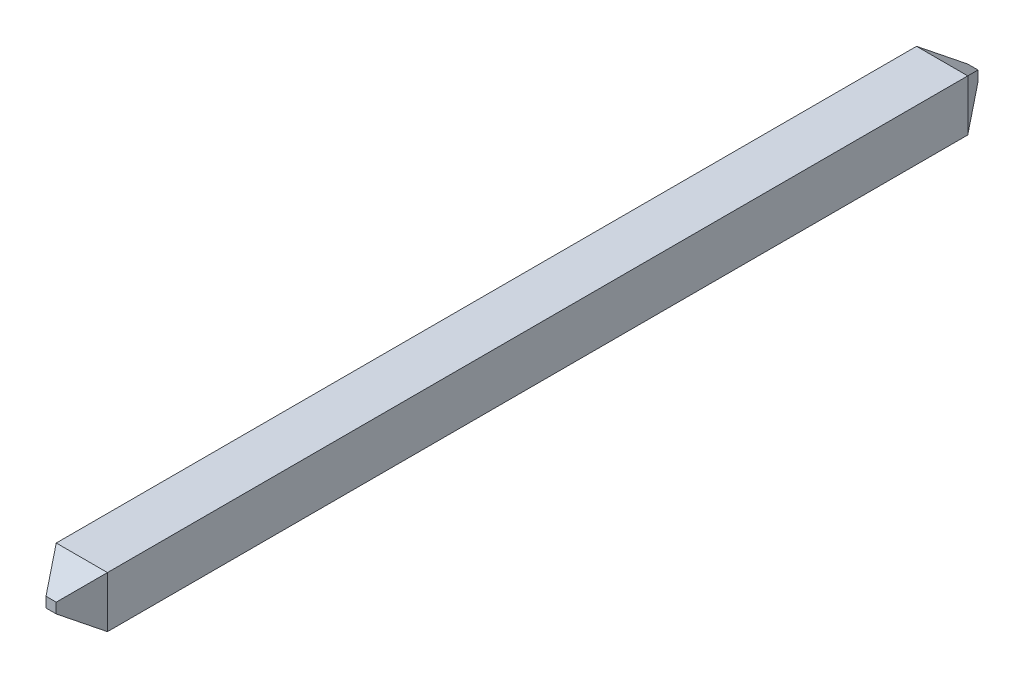
ISO-10303-21;
HEADER;
FILE_DESCRIPTION(('STEP AP214'),'2;1');
FILE_NAME('part.step','',(''),(''),'','','');
FILE_SCHEMA(('AUTOMOTIVE_DESIGN { 1 0 10303 214 1 1 1 1 }'));
ENDSEC;
DATA;
#1=APPLICATION_CONTEXT('core data for automotive mechanical design processes');
#2=APPLICATION_PROTOCOL_DEFINITION('international standard','automotive_design',2000,#1);
#3=PRODUCT_CONTEXT('',#1,'mechanical');
#4=PRODUCT('Part','Part','',(#3));
#5=PRODUCT_RELATED_PRODUCT_CATEGORY('part','',(#4));
#6=PRODUCT_DEFINITION_FORMATION('','',#4);
#7=PRODUCT_DEFINITION_CONTEXT('part definition',#1,'design');
#8=PRODUCT_DEFINITION('design','',#6,#7);
#9=PRODUCT_DEFINITION_SHAPE('','',#8);
#10=(LENGTH_UNIT() NAMED_UNIT(*) SI_UNIT(.MILLI.,.METRE.));
#11=(NAMED_UNIT(*) PLANE_ANGLE_UNIT() SI_UNIT($,.RADIAN.));
#12=(NAMED_UNIT(*) SI_UNIT($,.STERADIAN.) SOLID_ANGLE_UNIT());
#13=UNCERTAINTY_MEASURE_WITH_UNIT(LENGTH_MEASURE(1.E-05),#10,'distance_accuracy_value','');
#14=(GEOMETRIC_REPRESENTATION_CONTEXT(3) GLOBAL_UNCERTAINTY_ASSIGNED_CONTEXT((#13)) GLOBAL_UNIT_ASSIGNED_CONTEXT((#10,
#11,#12)) REPRESENTATION_CONTEXT('',''));
#15=CARTESIAN_POINT('',(0.,0.,0.));
#16=DIRECTION('',(0.,0.,1.));
#17=DIRECTION('',(1.,0.,0.));
#18=AXIS2_PLACEMENT_3D('',#15,#16,#17);
#19=CARTESIAN_POINT('',(-0.0635,0.,-6.35));
#20=DIRECTION('',(0.832050294337843,0.,0.55470019622523));
#21=DIRECTION('',(0.55470019622523,0.,-0.832050294337843));
#22=AXIS2_PLACEMENT_3D('',#19,#20,#21);
#23=PLANE('',#22);
#24=DIRECTION('',(0.,1.,0.));
#25=VECTOR('',#24,1.);
#26=CARTESIAN_POINT('',(-0.0635,0.,-6.35));
#27=LINE('',#26,#25);
#28=CARTESIAN_POINT('',(-0.0634999999999999,10.0965,-6.35));
#29=VERTEX_POINT('',#28);
#30=CARTESIAN_POINT('',(-0.0634999999999999,10.2235,-6.35));
#31=VERTEX_POINT('',#30);
#32=EDGE_CURVE('E19',#29,#31,#27,.T.);
#33=ORIENTED_EDGE('',*,*,#32,.F.);
#34=DIRECTION('',(-0.485071250072665,-0.485071250072667,0.727606875108999));
#35=VECTOR('',#34,1.);
#36=CARTESIAN_POINT('',(-0.0635,10.0965,-6.35));
#37=LINE('',#36,#35);
#38=CARTESIAN_POINT('',(-0.3175,9.8425,-5.969));
#39=VERTEX_POINT('',#38);
#40=EDGE_CURVE('E81',#29,#39,#37,.T.);
#41=ORIENTED_EDGE('',*,*,#40,.T.);
#42=DIRECTION('',(0.,1.,0.));
#43=VECTOR('',#42,1.);
#44=CARTESIAN_POINT('',(-0.3175,9.8425,-5.969));
#45=LINE('',#44,#43);
#46=CARTESIAN_POINT('',(-0.3175,10.4775,-5.969));
#47=VERTEX_POINT('',#46);
#48=EDGE_CURVE('E103',#47,#39,#45,.F.);
#49=ORIENTED_EDGE('',*,*,#48,.F.);
#50=DIRECTION('',(0.485071250072667,-0.485071250072668,-0.727606875108997));
#51=VECTOR('',#50,1.);
#52=CARTESIAN_POINT('',(-0.3175,10.4775,-5.969));
#53=LINE('',#52,#51);
#54=EDGE_CURVE('E84',#47,#31,#53,.T.);
#55=ORIENTED_EDGE('',*,*,#54,.T.);
#56=EDGE_LOOP('',(#33,#41,#49,#55));
#57=FACE_BOUND('',#56,.T.);
#58=ADVANCED_FACE('F16',(#57),#23,.F.);
#59=CARTESIAN_POINT('',(-0.3175,9.8425,4.699));
#60=DIRECTION('',(-0.832050294337844,0.,0.554700196225229));
#61=DIRECTION('',(0.554700196225229,0.,0.832050294337844));
#62=AXIS2_PLACEMENT_3D('',#59,#60,#61);
#63=PLANE('',#62);
#64=DIRECTION('',(0.485071250072666,-0.485071250072667,0.727606875108998));
#65=VECTOR('',#64,1.);
#66=CARTESIAN_POINT('',(-0.3175,10.4775,4.699));
#67=LINE('',#66,#65);
#68=CARTESIAN_POINT('',(-0.3175,10.4775,4.699));
#69=VERTEX_POINT('',#68);
#70=CARTESIAN_POINT('',(-0.0635,10.2235,5.08));
#71=VERTEX_POINT('',#70);
#72=EDGE_CURVE('E108',#69,#71,#67,.T.);
#73=ORIENTED_EDGE('',*,*,#72,.F.);
#74=DIRECTION('',(0.,1.,0.));
#75=VECTOR('',#74,1.);
#76=CARTESIAN_POINT('',(-0.3175,9.8425,4.699));
#77=LINE('',#76,#75);
#78=CARTESIAN_POINT('',(-0.3175,9.8425,4.699));
#79=VERTEX_POINT('',#78);
#80=EDGE_CURVE('E105',#79,#69,#77,.T.);
#81=ORIENTED_EDGE('',*,*,#80,.F.);
#82=DIRECTION('',(-0.485071250072665,-0.485071250072666,-0.727606875108999));
#83=VECTOR('',#82,1.);
#84=CARTESIAN_POINT('',(-0.0635,10.0965,5.08));
#85=LINE('',#84,#83);
#86=CARTESIAN_POINT('',(-0.0635,10.0965,5.08));
#87=VERTEX_POINT('',#86);
#88=EDGE_CURVE('E118',#87,#79,#85,.T.);
#89=ORIENTED_EDGE('',*,*,#88,.F.);
#90=DIRECTION('',(0.,1.,0.));
#91=VECTOR('',#90,1.);
#92=CARTESIAN_POINT('',(-0.0635,0.,5.08));
#93=LINE('',#92,#91);
#94=EDGE_CURVE('E111',#87,#71,#93,.T.);
#95=ORIENTED_EDGE('',*,*,#94,.T.);
#96=EDGE_LOOP('',(#73,#81,#89,#95));
#97=FACE_BOUND('',#96,.T.);
#98=ADVANCED_FACE('F182',(#97),#63,.T.);
#99=CARTESIAN_POINT('',(0.,0.,-6.35));
#100=DIRECTION('',(0.,0.,-1.));
#101=DIRECTION('',(-1.,0.,0.));
#102=AXIS2_PLACEMENT_3D('',#99,#100,#101);
#103=PLANE('',#102);
#104=ORIENTED_EDGE('',*,*,#32,.T.);
#105=DIRECTION('',(1.,0.,0.));
#106=VECTOR('',#105,1.);
#107=CARTESIAN_POINT('',(0.,10.2235,-6.35));
#108=LINE('',#107,#106);
#109=CARTESIAN_POINT('',(0.0634999999999999,10.2235,-6.35));
#110=VERTEX_POINT('',#109);
#111=EDGE_CURVE('E98',#31,#110,#108,.T.);
#112=ORIENTED_EDGE('',*,*,#111,.T.);
#113=DIRECTION('',(0.,1.,0.));
#114=VECTOR('',#113,1.);
#115=CARTESIAN_POINT('',(0.0635,0.,-6.35));
#116=LINE('',#115,#114);
#117=CARTESIAN_POINT('',(0.0634999999999999,10.0965,-6.35));
#118=VERTEX_POINT('',#117);
#119=EDGE_CURVE('E90',#110,#118,#116,.F.);
#120=ORIENTED_EDGE('',*,*,#119,.T.);
#121=DIRECTION('',(1.,0.,0.));
#122=VECTOR('',#121,1.);
#123=CARTESIAN_POINT('',(0.,10.0965,-6.35));
#124=LINE('',#123,#122);
#125=EDGE_CURVE('E86',#118,#29,#124,.F.);
#126=ORIENTED_EDGE('',*,*,#125,.T.);
#127=EDGE_LOOP('',(#104,#112,#120,#126));
#128=FACE_BOUND('',#127,.T.);
#129=ADVANCED_FACE('F88',(#128),#103,.T.);
#130=CARTESIAN_POINT('',(0.,10.0965,-6.35));
#131=DIRECTION('',(0.,0.832050294337843,0.554700196225231));
#132=DIRECTION('',(0.,-0.554700196225231,0.832050294337843));
#133=AXIS2_PLACEMENT_3D('',#130,#131,#132);
#134=PLANE('',#133);
#135=DIRECTION('',(1.,0.,0.));
#136=VECTOR('',#135,1.);
#137=CARTESIAN_POINT('',(0.3175,9.8425,-5.969));
#138=LINE('',#137,#136);
#139=CARTESIAN_POINT('',(0.3175,9.8425,-5.969));
#140=VERTEX_POINT('',#139);
#141=EDGE_CURVE('E96',#39,#140,#138,.T.);
#142=ORIENTED_EDGE('',*,*,#141,.F.);
#143=ORIENTED_EDGE('',*,*,#40,.F.);
#144=ORIENTED_EDGE('',*,*,#125,.F.);
#145=DIRECTION('',(0.485071250072665,-0.48507125007267,0.727606875108996));
#146=VECTOR('',#145,1.);
#147=CARTESIAN_POINT('',(0.0635,10.0965,-6.35));
#148=LINE('',#147,#146);
#149=EDGE_CURVE('E128',#118,#140,#148,.T.);
#150=ORIENTED_EDGE('',*,*,#149,.T.);
#151=EDGE_LOOP('',(#142,#143,#144,#150));
#152=FACE_BOUND('',#151,.T.);
#153=ADVANCED_FACE('F94',(#152),#134,.F.);
#154=CARTESIAN_POINT('',(0.,10.2235,-6.35));
#155=DIRECTION('',(0.,-0.832050294337843,0.554700196225231));
#156=DIRECTION('',(0.,-0.554700196225231,-0.832050294337843));
#157=AXIS2_PLACEMENT_3D('',#154,#155,#156);
#158=PLANE('',#157);
#159=DIRECTION('',(1.,0.,0.));
#160=VECTOR('',#159,1.);
#161=CARTESIAN_POINT('',(-0.3175,10.4775,-5.969));
#162=LINE('',#161,#160);
#163=CARTESIAN_POINT('',(0.3175,10.4775,-5.969));
#164=VERTEX_POINT('',#163);
#165=EDGE_CURVE('E133',#164,#47,#162,.F.);
#166=ORIENTED_EDGE('',*,*,#165,.F.);
#167=DIRECTION('',(-0.485071250072667,-0.485071250072665,-0.727606875108999));
#168=VECTOR('',#167,1.);
#169=CARTESIAN_POINT('',(0.3175,10.4775,-5.969));
#170=LINE('',#169,#168);
#171=EDGE_CURVE('E130',#164,#110,#170,.T.);
#172=ORIENTED_EDGE('',*,*,#171,.T.);
#173=ORIENTED_EDGE('',*,*,#111,.F.);
#174=ORIENTED_EDGE('',*,*,#54,.F.);
#175=EDGE_LOOP('',(#166,#172,#173,#174));
#176=FACE_BOUND('',#175,.T.);
#177=ADVANCED_FACE('F178',(#176),#158,.F.);
#178=CARTESIAN_POINT('',(-0.3175,9.8425,5.08));
#179=DIRECTION('',(-1.,0.,0.));
#180=DIRECTION('',(0.,0.,1.));
#181=AXIS2_PLACEMENT_3D('',#178,#179,#180);
#182=PLANE('',#181);
#183=DIRECTION('',(0.,0.,-1.));
#184=VECTOR('',#183,1.);
#185=CARTESIAN_POINT('',(-0.3175,9.8425,5.08));
#186=LINE('',#185,#184);
#187=EDGE_CURVE('E121',#79,#39,#186,.T.);
#188=ORIENTED_EDGE('',*,*,#187,.F.);
#189=ORIENTED_EDGE('',*,*,#80,.T.);
#190=DIRECTION('',(0.,0.,1.));
#191=VECTOR('',#190,1.);
#192=CARTESIAN_POINT('',(-0.3175,10.4775,5.08));
#193=LINE('',#192,#191);
#194=EDGE_CURVE('E136',#47,#69,#193,.T.);
#195=ORIENTED_EDGE('',*,*,#194,.F.);
#196=ORIENTED_EDGE('',*,*,#48,.T.);
#197=EDGE_LOOP('',(#188,#189,#195,#196));
#198=FACE_BOUND('',#197,.T.);
#199=ADVANCED_FACE('F180',(#198),#182,.T.);
#200=CARTESIAN_POINT('',(-0.3175,10.4775,4.699));
#201=DIRECTION('',(0.,0.832050294337843,0.55470019622523));
#202=DIRECTION('',(0.,-0.55470019622523,0.832050294337843));
#203=AXIS2_PLACEMENT_3D('',#200,#201,#202);
#204=PLANE('',#203);
#205=ORIENTED_EDGE('',*,*,#72,.T.);
#206=DIRECTION('',(-1.,0.,0.));
#207=VECTOR('',#206,1.);
#208=CARTESIAN_POINT('',(0.,10.2235,5.08));
#209=LINE('',#208,#207);
#210=CARTESIAN_POINT('',(0.0635,10.2235,5.08));
#211=VERTEX_POINT('',#210);
#212=EDGE_CURVE('E113',#71,#211,#209,.F.);
#213=ORIENTED_EDGE('',*,*,#212,.T.);
#214=DIRECTION('',(-0.485071250072666,-0.485071250072664,0.727606875109));
#215=VECTOR('',#214,1.);
#216=CARTESIAN_POINT('',(0.3175,10.4775,4.699));
#217=LINE('',#216,#215);
#218=CARTESIAN_POINT('',(0.3175,10.4775,4.699));
#219=VERTEX_POINT('',#218);
#220=EDGE_CURVE('E34',#219,#211,#217,.T.);
#221=ORIENTED_EDGE('',*,*,#220,.F.);
#222=DIRECTION('',(1.,0.,0.));
#223=VECTOR('',#222,1.);
#224=CARTESIAN_POINT('',(-0.3175,10.4775,4.699));
#225=LINE('',#224,#223);
#226=EDGE_CURVE('E139',#69,#219,#225,.T.);
#227=ORIENTED_EDGE('',*,*,#226,.F.);
#228=EDGE_LOOP('',(#205,#213,#221,#227));
#229=FACE_BOUND('',#228,.T.);
#230=ADVANCED_FACE('F184',(#229),#204,.T.);
#231=CARTESIAN_POINT('',(0.,0.,5.08));
#232=DIRECTION('',(0.,0.,-1.));
#233=DIRECTION('',(-1.,0.,0.));
#234=AXIS2_PLACEMENT_3D('',#231,#232,#233);
#235=PLANE('',#234);
#236=ORIENTED_EDGE('',*,*,#94,.F.);
#237=DIRECTION('',(1.,0.,0.));
#238=VECTOR('',#237,1.);
#239=CARTESIAN_POINT('',(0.3175,10.0965,5.08));
#240=LINE('',#239,#238);
#241=CARTESIAN_POINT('',(0.0635,10.0965,5.08));
#242=VERTEX_POINT('',#241);
#243=EDGE_CURVE('E115',#242,#87,#240,.F.);
#244=ORIENTED_EDGE('',*,*,#243,.F.);
#245=DIRECTION('',(0.,1.,0.));
#246=VECTOR('',#245,1.);
#247=CARTESIAN_POINT('',(0.0635,10.4775,5.08));
#248=LINE('',#247,#246);
#249=EDGE_CURVE('E142',#211,#242,#248,.F.);
#250=ORIENTED_EDGE('',*,*,#249,.F.);
#251=ORIENTED_EDGE('',*,*,#212,.F.);
#252=EDGE_LOOP('',(#236,#244,#250,#251));
#253=FACE_BOUND('',#252,.T.);
#254=ADVANCED_FACE('F186',(#253),#235,.F.);
#255=CARTESIAN_POINT('',(0.3175,9.8425,4.699));
#256=DIRECTION('',(0.,-0.832050294337843,0.55470019622523));
#257=DIRECTION('',(0.,-0.55470019622523,-0.832050294337843));
#258=AXIS2_PLACEMENT_3D('',#255,#256,#257);
#259=PLANE('',#258);
#260=ORIENTED_EDGE('',*,*,#88,.T.);
#261=DIRECTION('',(1.,0.,0.));
#262=VECTOR('',#261,1.);
#263=CARTESIAN_POINT('',(0.3175,9.8425,4.699));
#264=LINE('',#263,#262);
#265=CARTESIAN_POINT('',(0.3175,9.8425,4.699));
#266=VERTEX_POINT('',#265);
#267=EDGE_CURVE('E124',#266,#79,#264,.F.);
#268=ORIENTED_EDGE('',*,*,#267,.F.);
#269=DIRECTION('',(0.485071250072665,-0.485071250072669,-0.727606875108998));
#270=VECTOR('',#269,1.);
#271=CARTESIAN_POINT('',(0.0635,10.0965,5.08));
#272=LINE('',#271,#270);
#273=EDGE_CURVE('E145',#242,#266,#272,.T.);
#274=ORIENTED_EDGE('',*,*,#273,.F.);
#275=ORIENTED_EDGE('',*,*,#243,.T.);
#276=EDGE_LOOP('',(#260,#268,#274,#275));
#277=FACE_BOUND('',#276,.T.);
#278=ADVANCED_FACE('F168',(#277),#259,.T.);
#279=CARTESIAN_POINT('',(0.3175,9.8425,5.08));
#280=DIRECTION('',(0.,-1.,0.));
#281=DIRECTION('',(0.,0.,-1.));
#282=AXIS2_PLACEMENT_3D('',#279,#280,#281);
#283=PLANE('',#282);
#284=DIRECTION('',(0.,0.,-1.));
#285=VECTOR('',#284,1.);
#286=CARTESIAN_POINT('',(0.3175,9.8425,5.08));
#287=LINE('',#286,#285);
#288=EDGE_CURVE('E148',#266,#140,#287,.T.);
#289=ORIENTED_EDGE('',*,*,#288,.F.);
#290=ORIENTED_EDGE('',*,*,#267,.T.);
#291=ORIENTED_EDGE('',*,*,#187,.T.);
#292=ORIENTED_EDGE('',*,*,#141,.T.);
#293=EDGE_LOOP('',(#289,#290,#291,#292));
#294=FACE_BOUND('',#293,.T.);
#295=ADVANCED_FACE('F172',(#294),#283,.T.);
#296=CARTESIAN_POINT('',(0.0635,0.,-6.35));
#297=DIRECTION('',(-0.832050294337843,0.,0.55470019622523));
#298=DIRECTION('',(0.55470019622523,0.,0.832050294337843));
#299=AXIS2_PLACEMENT_3D('',#296,#297,#298);
#300=PLANE('',#299);
#301=DIRECTION('',(0.,1.,0.));
#302=VECTOR('',#301,1.);
#303=CARTESIAN_POINT('',(0.3175,10.4775,-5.969));
#304=LINE('',#303,#302);
#305=EDGE_CURVE('E151',#140,#164,#304,.T.);
#306=ORIENTED_EDGE('',*,*,#305,.F.);
#307=ORIENTED_EDGE('',*,*,#149,.F.);
#308=ORIENTED_EDGE('',*,*,#119,.F.);
#309=ORIENTED_EDGE('',*,*,#171,.F.);
#310=EDGE_LOOP('',(#306,#307,#308,#309));
#311=FACE_BOUND('',#310,.T.);
#312=ADVANCED_FACE('F176',(#311),#300,.F.);
#313=CARTESIAN_POINT('',(-0.3175,10.4775,5.08));
#314=DIRECTION('',(0.,1.,0.));
#315=DIRECTION('',(0.,0.,1.));
#316=AXIS2_PLACEMENT_3D('',#313,#314,#315);
#317=PLANE('',#316);
#318=ORIENTED_EDGE('',*,*,#194,.T.);
#319=ORIENTED_EDGE('',*,*,#226,.T.);
#320=DIRECTION('',(0.,0.,-1.));
#321=VECTOR('',#320,1.);
#322=CARTESIAN_POINT('',(0.3175,10.4775,5.08));
#323=LINE('',#322,#321);
#324=EDGE_CURVE('E25',#164,#219,#323,.F.);
#325=ORIENTED_EDGE('',*,*,#324,.F.);
#326=ORIENTED_EDGE('',*,*,#165,.T.);
#327=EDGE_LOOP('',(#318,#319,#325,#326));
#328=FACE_BOUND('',#327,.T.);
#329=ADVANCED_FACE('F161',(#328),#317,.T.);
#330=CARTESIAN_POINT('',(0.3175,10.4775,4.699));
#331=DIRECTION('',(0.832050294337844,0.,0.554700196225229));
#332=DIRECTION('',(0.554700196225229,0.,-0.832050294337844));
#333=AXIS2_PLACEMENT_3D('',#330,#331,#332);
#334=PLANE('',#333);
#335=ORIENTED_EDGE('',*,*,#273,.T.);
#336=DIRECTION('',(0.,1.,0.));
#337=VECTOR('',#336,1.);
#338=CARTESIAN_POINT('',(0.3175,10.4775,4.699));
#339=LINE('',#338,#337);
#340=EDGE_CURVE('E11',#219,#266,#339,.F.);
#341=ORIENTED_EDGE('',*,*,#340,.F.);
#342=ORIENTED_EDGE('',*,*,#220,.T.);
#343=ORIENTED_EDGE('',*,*,#249,.T.);
#344=EDGE_LOOP('',(#335,#341,#342,#343));
#345=FACE_BOUND('',#344,.T.);
#346=ADVANCED_FACE('F164',(#345),#334,.T.);
#347=CARTESIAN_POINT('',(0.3175,10.4775,5.08));
#348=DIRECTION('',(1.,0.,0.));
#349=DIRECTION('',(0.,0.,-1.));
#350=AXIS2_PLACEMENT_3D('',#347,#348,#349);
#351=PLANE('',#350);
#352=ORIENTED_EDGE('',*,*,#324,.T.);
#353=ORIENTED_EDGE('',*,*,#340,.T.);
#354=ORIENTED_EDGE('',*,*,#288,.T.);
#355=ORIENTED_EDGE('',*,*,#305,.T.);
#356=EDGE_LOOP('',(#352,#353,#354,#355));
#357=FACE_BOUND('',#356,.T.);
#358=ADVANCED_FACE('F157',(#357),#351,.T.);
#359=CLOSED_SHELL('',(#58,#98,#129,#153,#177,#199,#230,#254,#278,#295,#312,#329,#346,#358));
#360=MANIFOLD_SOLID_BREP('B1',#359);
#361=ADVANCED_BREP_SHAPE_REPRESENTATION('',(#18,#360),#14);
#362=SHAPE_DEFINITION_REPRESENTATION(#9,#361);
ENDSEC;
END-ISO-10303-21;
